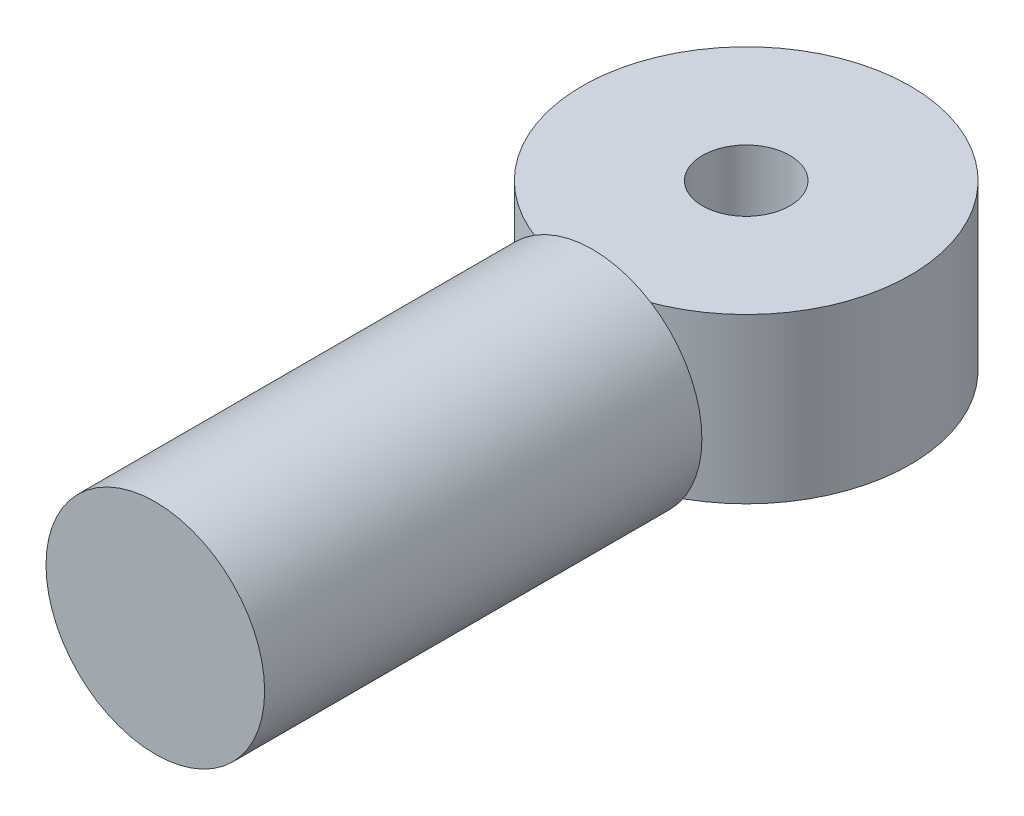
ISO-10303-21;
HEADER;
FILE_DESCRIPTION(('STEP AP214'),'2;1');
FILE_NAME('part.step','',(''),(''),'','','');
FILE_SCHEMA(('AUTOMOTIVE_DESIGN { 1 0 10303 214 1 1 1 1 }'));
ENDSEC;
DATA;
#1=APPLICATION_CONTEXT('core data for automotive mechanical design processes');
#2=APPLICATION_PROTOCOL_DEFINITION('international standard','automotive_design',2000,#1);
#3=PRODUCT_CONTEXT('',#1,'mechanical');
#4=PRODUCT('Part','Part','',(#3));
#5=PRODUCT_RELATED_PRODUCT_CATEGORY('part','',(#4));
#6=PRODUCT_DEFINITION_FORMATION('','',#4);
#7=PRODUCT_DEFINITION_CONTEXT('part definition',#1,'design');
#8=PRODUCT_DEFINITION('design','',#6,#7);
#9=PRODUCT_DEFINITION_SHAPE('','',#8);
#10=(LENGTH_UNIT() NAMED_UNIT(*) SI_UNIT(.MILLI.,.METRE.));
#11=(NAMED_UNIT(*) PLANE_ANGLE_UNIT() SI_UNIT($,.RADIAN.));
#12=(NAMED_UNIT(*) SI_UNIT($,.STERADIAN.) SOLID_ANGLE_UNIT());
#13=UNCERTAINTY_MEASURE_WITH_UNIT(LENGTH_MEASURE(1.E-05),#10,'distance_accuracy_value','');
#14=(GEOMETRIC_REPRESENTATION_CONTEXT(3) GLOBAL_UNCERTAINTY_ASSIGNED_CONTEXT((#13)) GLOBAL_UNIT_ASSIGNED_CONTEXT((#10,
#11,#12)) REPRESENTATION_CONTEXT('',''));
#15=CARTESIAN_POINT('',(0.,0.,0.));
#16=DIRECTION('',(0.,0.,1.));
#17=DIRECTION('',(1.,0.,0.));
#18=AXIS2_PLACEMENT_3D('',#15,#16,#17);
#19=CARTESIAN_POINT('',(0.,0.,0.));
#20=DIRECTION('',(0.,0.,1.));
#21=DIRECTION('',(1.,0.,0.));
#22=AXIS2_PLACEMENT_3D('',#19,#20,#21);
#23=PLANE('',#22);
#24=CARTESIAN_POINT('',(0.,0.,0.));
#25=DIRECTION('',(0.,0.,1.));
#26=DIRECTION('',(1.,0.,0.));
#27=AXIS2_PLACEMENT_3D('',#24,#25,#26);
#28=CIRCLE('',#27,10.);
#29=CARTESIAN_POINT('',(10.,0.,0.));
#30=VERTEX_POINT('',#29);
#31=EDGE_CURVE('E78',#30,#30,#28,.T.);
#32=ORIENTED_EDGE('',*,*,#31,.F.);
#33=EDGE_LOOP('',(#32));
#34=FACE_BOUND('',#33,.T.);
#35=DIRECTION('',(0.,-1.,0.));
#36=VECTOR('',#35,1.);
#37=CARTESIAN_POINT('',(-1.83431269007996,7.5,0.));
#38=LINE('',#37,#36);
#39=CARTESIAN_POINT('',(-1.83431269007996,-7.5,0.));
#40=VERTEX_POINT('',#39);
#41=CARTESIAN_POINT('',(-1.83431269007996,7.5,0.));
#42=VERTEX_POINT('',#41);
#43=EDGE_CURVE('E12',#40,#42,#38,.F.);
#44=ORIENTED_EDGE('',*,*,#43,.F.);
#45=DIRECTION('',(-1.,0.,0.));
#46=VECTOR('',#45,1.);
#47=CARTESIAN_POINT('',(0.,-7.5,0.));
#48=LINE('',#47,#46);
#49=CARTESIAN_POINT('',(0.,-7.5,0.));
#50=VERTEX_POINT('',#49);
#51=EDGE_CURVE('E60',#50,#40,#48,.T.);
#52=ORIENTED_EDGE('',*,*,#51,.F.);
#53=DIRECTION('',(0.,-1.,0.));
#54=VECTOR('',#53,1.);
#55=CARTESIAN_POINT('',(0.,7.5,0.));
#56=LINE('',#55,#54);
#57=CARTESIAN_POINT('',(0.,7.5,0.));
#58=VERTEX_POINT('',#57);
#59=EDGE_CURVE('E62',#58,#50,#56,.T.);
#60=ORIENTED_EDGE('',*,*,#59,.F.);
#61=DIRECTION('',(-1.,0.,0.));
#62=VECTOR('',#61,1.);
#63=CARTESIAN_POINT('',(0.,7.5,0.));
#64=LINE('',#63,#62);
#65=EDGE_CURVE('E47',#58,#42,#64,.T.);
#66=ORIENTED_EDGE('',*,*,#65,.T.);
#67=EDGE_LOOP('',(#44,#52,#60,#66));
#68=FACE_BOUND('',#67,.T.);
#69=ADVANCED_FACE('F39',(#34,#68),#23,.F.);
#70=CARTESIAN_POINT('',(0.,0.,40.));
#71=DIRECTION('',(0.,0.,-1.));
#72=DIRECTION('',(-1.,0.,0.));
#73=AXIS2_PLACEMENT_3D('',#70,#71,#72);
#74=CYLINDRICAL_SURFACE('',#73,10.);
#75=CARTESIAN_POINT('',(0.,0.,40.));
#76=DIRECTION('',(0.,0.,1.));
#77=DIRECTION('',(1.,0.,0.));
#78=AXIS2_PLACEMENT_3D('',#75,#76,#77);
#79=CIRCLE('',#78,10.);
#80=CARTESIAN_POINT('',(10.,0.,40.));
#81=VERTEX_POINT('',#80);
#82=EDGE_CURVE('E73',#81,#81,#79,.T.);
#83=ORIENTED_EDGE('',*,*,#82,.F.);
#84=EDGE_LOOP('',(#83));
#85=FACE_BOUND('',#84,.T.);
#86=ORIENTED_EDGE('',*,*,#31,.T.);
#87=EDGE_LOOP('',(#86));
#88=FACE_BOUND('',#87,.T.);
#89=ADVANCED_FACE('F41',(#85,#88),#74,.T.);
#90=CARTESIAN_POINT('',(0.,0.,40.));
#91=DIRECTION('',(0.,0.,1.));
#92=DIRECTION('',(1.,0.,0.));
#93=AXIS2_PLACEMENT_3D('',#90,#91,#92);
#94=PLANE('',#93);
#95=ORIENTED_EDGE('',*,*,#82,.T.);
#96=EDGE_LOOP('',(#95));
#97=FACE_BOUND('',#96,.T.);
#98=ADVANCED_FACE('F95',(#97),#94,.T.);
#99=CARTESIAN_POINT('',(-0.917156345039967,7.5,-14.9719345523133));
#100=DIRECTION('',(0.,1.,0.));
#101=DIRECTION('',(0.,0.,1.));
#102=AXIS2_PLACEMENT_3D('',#99,#100,#101);
#103=PLANE('',#102);
#104=CARTESIAN_POINT('',(-0.917156345039967,7.5,-14.9719345523133));
#105=DIRECTION('',(0.,1.,0.));
#106=DIRECTION('',(0.,0.,1.));
#107=AXIS2_PLACEMENT_3D('',#104,#105,#106);
#108=CIRCLE('',#107,4.);
#109=CARTESIAN_POINT('',(-0.917156345039967,7.5,-10.9719345523133));
#110=VERTEX_POINT('',#109);
#111=EDGE_CURVE('E76',#110,#110,#108,.T.);
#112=ORIENTED_EDGE('',*,*,#111,.F.);
#113=EDGE_LOOP('',(#112));
#114=FACE_BOUND('',#113,.T.);
#115=ORIENTED_EDGE('',*,*,#65,.F.);
#116=CARTESIAN_POINT('',(-0.917156345039967,7.5,-14.9719345523133));
#117=DIRECTION('',(0.,1.,0.));
#118=DIRECTION('',(0.,0.,1.));
#119=AXIS2_PLACEMENT_3D('',#116,#117,#118);
#120=CIRCLE('',#119,15.);
#121=EDGE_CURVE('E72',#58,#42,#120,.T.);
#122=ORIENTED_EDGE('',*,*,#121,.T.);
#123=EDGE_LOOP('',(#115,#122));
#124=FACE_BOUND('',#123,.T.);
#125=ADVANCED_FACE('F100',(#114,#124),#103,.T.);
#126=CARTESIAN_POINT('',(-0.917156345039967,-7.5,-14.9719345523133));
#127=DIRECTION('',(0.,1.,0.));
#128=DIRECTION('',(0.,0.,1.));
#129=AXIS2_PLACEMENT_3D('',#126,#127,#128);
#130=PLANE('',#129);
#131=CARTESIAN_POINT('',(-0.917156345039967,-7.5,-14.9719345523133));
#132=DIRECTION('',(0.,1.,0.));
#133=DIRECTION('',(0.,0.,1.));
#134=AXIS2_PLACEMENT_3D('',#131,#132,#133);
#135=CIRCLE('',#134,4.);
#136=CARTESIAN_POINT('',(-0.917156345039967,-7.5,-10.9719345523133));
#137=VERTEX_POINT('',#136);
#138=EDGE_CURVE('E81',#137,#137,#135,.T.);
#139=ORIENTED_EDGE('',*,*,#138,.T.);
#140=EDGE_LOOP('',(#139));
#141=FACE_BOUND('',#140,.T.);
#142=CARTESIAN_POINT('',(-0.917156345039967,-7.5,-14.9719345523133));
#143=DIRECTION('',(0.,1.,0.));
#144=DIRECTION('',(0.,0.,1.));
#145=AXIS2_PLACEMENT_3D('',#142,#143,#144);
#146=CIRCLE('',#145,15.);
#147=EDGE_CURVE('E70',#50,#40,#146,.T.);
#148=ORIENTED_EDGE('',*,*,#147,.F.);
#149=ORIENTED_EDGE('',*,*,#51,.T.);
#150=EDGE_LOOP('',(#148,#149));
#151=FACE_BOUND('',#150,.T.);
#152=ADVANCED_FACE('F75',(#141,#151),#130,.F.);
#153=CARTESIAN_POINT('',(-0.917156345039967,7.5,-14.9719345523133));
#154=DIRECTION('',(0.,-1.,0.));
#155=DIRECTION('',(0.,0.,-1.));
#156=AXIS2_PLACEMENT_3D('',#153,#154,#155);
#157=CYLINDRICAL_SURFACE('',#156,15.);
#158=ORIENTED_EDGE('',*,*,#147,.T.);
#159=ORIENTED_EDGE('',*,*,#43,.T.);
#160=ORIENTED_EDGE('',*,*,#121,.F.);
#161=ORIENTED_EDGE('',*,*,#59,.T.);
#162=EDGE_LOOP('',(#158,#159,#160,#161));
#163=FACE_BOUND('',#162,.T.);
#164=ADVANCED_FACE('F69',(#163),#157,.T.);
#165=CARTESIAN_POINT('',(-0.917156345039967,7.5,-14.9719345523133));
#166=DIRECTION('',(0.,-1.,0.));
#167=DIRECTION('',(0.,0.,-1.));
#168=AXIS2_PLACEMENT_3D('',#165,#166,#167);
#169=CYLINDRICAL_SURFACE('',#168,4.);
#170=ORIENTED_EDGE('',*,*,#111,.T.);
#171=EDGE_LOOP('',(#170));
#172=FACE_BOUND('',#171,.T.);
#173=ORIENTED_EDGE('',*,*,#138,.F.);
#174=EDGE_LOOP('',(#173));
#175=FACE_BOUND('',#174,.T.);
#176=ADVANCED_FACE('F104',(#172,#175),#169,.F.);
#177=CLOSED_SHELL('',(#69,#89,#98,#125,#152,#164,#176));
#178=MANIFOLD_SOLID_BREP('B2',#177);
#179=ADVANCED_BREP_SHAPE_REPRESENTATION('',(#18,#178),#14);
#180=SHAPE_DEFINITION_REPRESENTATION(#9,#179);
ENDSEC;
END-ISO-10303-21;
